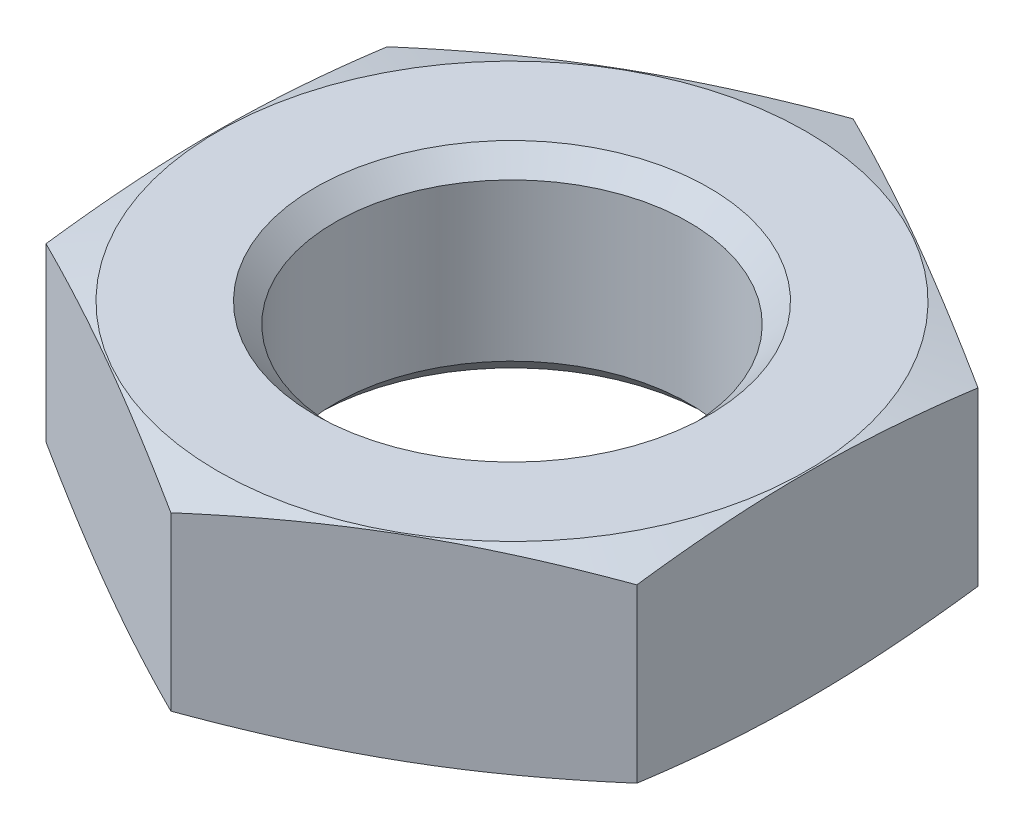
ISO-10303-21;
HEADER;
FILE_DESCRIPTION(('STEP AP214'),'2;1');
FILE_NAME('part.step','',(''),(''),'','','');
FILE_SCHEMA(('AUTOMOTIVE_DESIGN { 1 0 10303 214 1 1 1 1 }'));
ENDSEC;
DATA;
#1=APPLICATION_CONTEXT('core data for automotive mechanical design processes');
#2=APPLICATION_PROTOCOL_DEFINITION('international standard','automotive_design',2000,#1);
#3=PRODUCT_CONTEXT('',#1,'mechanical');
#4=PRODUCT('Part','Part','',(#3));
#5=PRODUCT_RELATED_PRODUCT_CATEGORY('part','',(#4));
#6=PRODUCT_DEFINITION_FORMATION('','',#4);
#7=PRODUCT_DEFINITION_CONTEXT('part definition',#1,'design');
#8=PRODUCT_DEFINITION('design','',#6,#7);
#9=PRODUCT_DEFINITION_SHAPE('','',#8);
#10=(LENGTH_UNIT() NAMED_UNIT(*) SI_UNIT(.MILLI.,.METRE.));
#11=(NAMED_UNIT(*) PLANE_ANGLE_UNIT() SI_UNIT($,.RADIAN.));
#12=(NAMED_UNIT(*) SI_UNIT($,.STERADIAN.) SOLID_ANGLE_UNIT());
#13=UNCERTAINTY_MEASURE_WITH_UNIT(LENGTH_MEASURE(1.E-05),#10,'distance_accuracy_value','');
#14=(GEOMETRIC_REPRESENTATION_CONTEXT(3) GLOBAL_UNCERTAINTY_ASSIGNED_CONTEXT((#13)) GLOBAL_UNIT_ASSIGNED_CONTEXT((#10,
#11,#12)) REPRESENTATION_CONTEXT('',''));
#15=CARTESIAN_POINT('',(0.,0.,0.));
#16=DIRECTION('',(0.,0.,1.));
#17=DIRECTION('',(1.,0.,0.));
#18=AXIS2_PLACEMENT_3D('',#15,#16,#17);
#19=CARTESIAN_POINT('',(0.,0.,0.));
#20=DIRECTION('',(0.,1.,0.));
#21=DIRECTION('',(0.,0.,1.));
#22=AXIS2_PLACEMENT_3D('',#19,#20,#21);
#23=PLANE('',#22);
#24=CARTESIAN_POINT('',(0.,0.,0.));
#25=DIRECTION('',(0.,-1.,0.));
#26=DIRECTION('',(0.,0.,-1.));
#27=AXIS2_PLACEMENT_3D('',#24,#25,#26);
#28=CIRCLE('',#27,11.95);
#29=CARTESIAN_POINT('',(0.,0.,-11.95));
#30=VERTEX_POINT('',#29);
#31=EDGE_CURVE('E119',#30,#30,#28,.T.);
#32=ORIENTED_EDGE('',*,*,#31,.F.);
#33=EDGE_LOOP('',(#32));
#34=FACE_BOUND('',#33,.T.);
#35=CARTESIAN_POINT('',(0.,0.,0.));
#36=DIRECTION('',(0.,1.,0.));
#37=DIRECTION('',(0.,0.,1.));
#38=AXIS2_PLACEMENT_3D('',#35,#36,#37);
#39=CIRCLE('',#38,8.);
#40=CARTESIAN_POINT('',(0.,0.,8.));
#41=VERTEX_POINT('',#40);
#42=EDGE_CURVE('E110',#41,#41,#39,.T.);
#43=ORIENTED_EDGE('',*,*,#42,.F.);
#44=EDGE_LOOP('',(#43));
#45=FACE_BOUND('',#44,.T.);
#46=ADVANCED_FACE('F41',(#34,#45),#23,.T.);
#47=CARTESIAN_POINT('',(11.95,-8.,0.));
#48=DIRECTION('',(0.,-1.,0.));
#49=DIRECTION('',(0.,0.,-1.));
#50=AXIS2_PLACEMENT_3D('',#47,#48,#49);
#51=PLANE('',#50);
#52=CARTESIAN_POINT('',(0.,-8.,0.));
#53=DIRECTION('',(0.,-1.,0.));
#54=DIRECTION('',(0.,0.,-1.));
#55=AXIS2_PLACEMENT_3D('',#52,#53,#54);
#56=CIRCLE('',#55,11.95);
#57=CARTESIAN_POINT('',(0.,-8.,-11.95));
#58=VERTEX_POINT('',#57);
#59=EDGE_CURVE('E116',#58,#58,#56,.T.);
#60=ORIENTED_EDGE('',*,*,#59,.T.);
#61=EDGE_LOOP('',(#60));
#62=FACE_BOUND('',#61,.T.);
#63=CARTESIAN_POINT('',(0.,-8.,0.));
#64=DIRECTION('',(0.,1.,0.));
#65=DIRECTION('',(0.,0.,1.));
#66=AXIS2_PLACEMENT_3D('',#63,#64,#65);
#67=CIRCLE('',#66,8.);
#68=CARTESIAN_POINT('',(0.,-8.,8.));
#69=VERTEX_POINT('',#68);
#70=EDGE_CURVE('E354',#69,#69,#67,.T.);
#71=ORIENTED_EDGE('',*,*,#70,.T.);
#72=EDGE_LOOP('',(#71));
#73=FACE_BOUND('',#72,.T.);
#74=ADVANCED_FACE('F142',(#62,#73),#51,.T.);
#75=CARTESIAN_POINT('',(0.,-4.,0.));
#76=DIRECTION('',(0.,-1.,0.));
#77=DIRECTION('',(0.,0.,-1.));
#78=AXIS2_PLACEMENT_3D('',#75,#76,#77);
#79=CONICAL_SURFACE('',#78,26.878203230276,1.30899693899576);
#80=ORIENTED_EDGE('',*,*,#31,.T.);
#81=EDGE_LOOP('',(#80));
#82=FACE_BOUND('',#81,.T.);
#83=CARTESIAN_POINT('',(0.000200000000000058,-0.510851012044523,-13.8565219306048));
#84=CARTESIAN_POINT('',(-0.498146454182599,-0.433725446206075,-13.5688014711328));
#85=CARTESIAN_POINT('',(-0.997396444623649,-0.363708257028747,-13.2805593547588));
#86=CARTESIAN_POINT('',(-1.99765949891959,-0.240694738972747,-12.7030572111006));
#87=CARTESIAN_POINT('',(-2.49867319556912,-0.187705323065098,-12.4137968184723));
#88=CARTESIAN_POINT('',(-3.49942613336507,-0.101840731579633,-11.8360118404435));
#89=CARTESIAN_POINT('',(-3.99915860797725,-0.0688631626605933,-11.5474911617033));
#90=CARTESIAN_POINT('',(-4.99926081641629,-0.0246436291699184,-10.9700818824439));
#91=CARTESIAN_POINT('',(-5.49963040820814,-0.0133974596215532,-10.6811933639286));
#92=CARTESIAN_POINT('',(-6.50036959179186,-0.0133974596215535,-10.1034163268979));
#93=CARTESIAN_POINT('',(-7.00073918358372,-0.0246436291699189,-9.81452780838259));
#94=CARTESIAN_POINT('',(-8.00084139202275,-0.0688631626605943,-9.23711852912317));
#95=CARTESIAN_POINT('',(-8.50057386663493,-0.101840731579634,-8.94859785038303));
#96=CARTESIAN_POINT('',(-9.50132680443088,-0.1877053230651,-8.37081287235423));
#97=CARTESIAN_POINT('',(-10.0023405010804,-0.24069473897275,-8.08155247972594));
#98=CARTESIAN_POINT('',(-11.0026035553764,-0.363708257028751,-7.50405033606774));
#99=CARTESIAN_POINT('',(-11.5018535458174,-0.43372544620608,-7.21580821969368));
#100=CARTESIAN_POINT('',(-12.0002,-0.510851012044527,-6.92808776022166));
#101=B_SPLINE_CURVE_WITH_KNOTS('',3,(#83,#84,#85,#86,#87,#88,#89,#90,#91,#92,#93,#94,#95,#96,
#97,#98,#99,#100),.UNSPECIFIED.,.F.,.F.,(4,2,2,2,2,2,2,2,4),(0.,1.74185054469228,
3.48440735870376,5.21797126724054,6.95119970147062,8.68442813570069,10.4179920442375,
12.160548858249,13.9023994029412),.UNSPECIFIED.);
#102=CARTESIAN_POINT('',(0.,-0.510820071550099,-13.856406460551));
#103=VERTEX_POINT('',#102);
#104=CARTESIAN_POINT('',(-12.,-0.510820071550103,-6.9282032302755));
#105=VERTEX_POINT('',#104);
#106=EDGE_CURVE('E115',#103,#105,#101,.T.);
#107=ORIENTED_EDGE('',*,*,#106,.T.);
#108=CARTESIAN_POINT('',(-12.,-2.72200243573631,-18.5685881589845));
#109=CARTESIAN_POINT('',(-12.,-2.59887367410678,-18.0213144233399));
#110=CARTESIAN_POINT('',(-12.,-2.47721112690191,-17.4737049482329));
#111=CARTESIAN_POINT('',(-12.,-2.23761044271416,-16.3776490741173));
#112=CARTESIAN_POINT('',(-12.,-2.11967245964341,-15.8292026415019));
#113=CARTESIAN_POINT('',(-12.,-1.88821805394612,-14.7308536896472));
#114=CARTESIAN_POINT('',(-12.,-1.7747057470629,-14.1809503000857));
#115=CARTESIAN_POINT('',(-12.,-1.55328922851542,-13.0800161890277));
#116=CARTESIAN_POINT('',(-12.,-1.44538497183806,-12.5289854766164));
#117=CARTESIAN_POINT('',(-12.,-1.23738313901807,-11.4301285119202));
#118=CARTESIAN_POINT('',(-12.,-1.1372287766694,-10.8823130603761));
#119=CARTESIAN_POINT('',(-12.,-0.94539932182392,-9.78518803384904));
#120=CARTESIAN_POINT('',(-12.,-0.853724259748671,-9.23587845351272));
#121=CARTESIAN_POINT('',(-12.,-0.680869488273906,-8.13564720164665));
#122=CARTESIAN_POINT('',(-12.,-0.599688831632448,-7.58472568021016));
#123=CARTESIAN_POINT('',(-12.,-0.45016964484819,-6.48112261453464));
#124=CARTESIAN_POINT('',(-12.,-0.381831137110084,-5.92844106722672));
#125=CARTESIAN_POINT('',(-12.,-0.259875137443977,-4.81496459343015));
#126=CARTESIAN_POINT('',(-12.,-0.206436959937335,-4.25414973515133));
#127=CARTESIAN_POINT('',(-12.,-0.117937409932045,-3.13105911511348));
#128=CARTESIAN_POINT('',(-12.,-0.082875615099266,-2.56878338722729));
#129=CARTESIAN_POINT('',(-12.,-0.0331702079703489,-1.44359947920516));
#130=CARTESIAN_POINT('',(-12.,-0.0185161724162358,-0.880691768998626));
#131=CARTESIAN_POINT('',(-12.,-0.0105322094798444,0.245276542205507));
#132=CARTESIAN_POINT('',(-12.,-0.0172022244136304,0.808337142785403));
#133=CARTESIAN_POINT('',(-12.,-0.0514991431895747,1.93602470881299));
#134=CARTESIAN_POINT('',(-12.,-0.0792084260695917,2.50064911702469));
#135=CARTESIAN_POINT('',(-12.,-0.153987570721919,3.62860269943232));
#136=CARTESIAN_POINT('',(-12.,-0.201057877482643,4.191931843559));
#137=CARTESIAN_POINT('',(-12.,-0.312122503045244,5.31729206801284));
#138=CARTESIAN_POINT('',(-12.,-0.37612867825736,5.87932195961845));
#139=CARTESIAN_POINT('',(-12.,-0.518327678875515,7.00156206794212));
#140=CARTESIAN_POINT('',(-12.,-0.596520524071002,7.56177228212074));
#141=CARTESIAN_POINT('',(-12.,-0.766895056384889,8.69626616322598));
#142=CARTESIAN_POINT('',(-12.,-0.859410078687846,9.27049930408447));
#143=CARTESIAN_POINT('',(-12.,-1.05429882669755,10.4172994207027));
#144=CARTESIAN_POINT('',(-12.,-1.15667292750077,10.9898663322149));
#145=CARTESIAN_POINT('',(-12.,-1.36930877556067,12.133607994569));
#146=CARTESIAN_POINT('',(-12.,-1.47957161960214,12.7047825403681));
#147=CARTESIAN_POINT('',(-12.,-1.70639259662026,13.8458673155559));
#148=CARTESIAN_POINT('',(-12.,-1.8229506482758,14.4157775611777));
#149=CARTESIAN_POINT('',(-12.,-2.06116971090088,15.5547484527927));
#150=CARTESIAN_POINT('',(-12.,-2.1828326035334,16.1238087039973));
#151=CARTESIAN_POINT('',(-12.,-2.43025398289181,17.2610373820955));
#152=CARTESIAN_POINT('',(-12.,-2.55601247903592,17.8292058069352));
#153=CARTESIAN_POINT('',(-12.,-2.81085668528537,18.9647431445852));
#154=CARTESIAN_POINT('',(-12.,-2.93994210724294,19.5321121221771));
#155=CARTESIAN_POINT('',(-12.,-3.2008620713177,20.6662181855463));
#156=CARTESIAN_POINT('',(-12.,-3.33269662086052,21.2329552696124));
#157=CARTESIAN_POINT('',(-12.,-3.72858989385038,22.9195613633749));
#158=CARTESIAN_POINT('',(-12.,-3.99594280080609,24.0386569627157));
#159=CARTESIAN_POINT('',(-12.,-4.53688835016327,26.2753619296082));
#160=CARTESIAN_POINT('',(-12.,-4.81048114599739,27.3929712598974));
#161=CARTESIAN_POINT('',(-12.,-5.36180720199379,29.6253788982862));
#162=CARTESIAN_POINT('',(-12.,-5.63953359587728,30.7401789038594));
#163=CARTESIAN_POINT('',(-12.,-6.05867034126459,32.4117164998776));
#164=CARTESIAN_POINT('',(-12.,-6.19880444745633,32.9687747923526));
#165=CARTESIAN_POINT('',(-12.,-6.47982167483764,34.0827018740917));
#166=CARTESIAN_POINT('',(-12.,-6.62070479530794,34.6395706635373));
#167=CARTESIAN_POINT('',(-12.,-6.76191169280589,35.1963573745801));
#168=B_SPLINE_CURVE_WITH_KNOTS('',3,(#108,#109,#110,#111,#112,#113,#114,#115,#116,#117,#118,
#119,#120,#121,#122,#123,#124,#125,#126,#127,#128,#129,#130,#131,#132,#133,#134,#135,#136,#137,
#138,#139,#140,#141,#142,#143,#144,#145,#146,#147,#148,#149,#150,#151,#152,#153,#154,#155,#156,
#157,#158,#159,#160,#161,#162,#163,#164,#165,#166,#167),.UNSPECIFIED.,.F.,.F.,(4,2,2,2,2,2,2,2,
2,2,2,2,2,2,2,2,2,2,2,2,2,2,2,2,2,2,2,2,2,4),(0.,1.68286813278142,3.36580571685892,
5.05027276265678,6.73472628597062,8.40535978198167,10.0759992715661,11.7464878610926,
13.416979364963,15.1067824841314,16.7965467657959,18.4854476838572,20.174344033257,
21.8698875600161,23.5654700588562,25.262242751023,26.9590178100915,28.7038248804626,
30.4486983596481,32.1938149046289,33.9389089116925,35.6846519169557,37.4303989369993,
39.1759952612339,40.9215963010863,44.3733305526461,47.8251497706189,51.2717634428849,
52.9950052531451,54.7182454089179),.UNSPECIFIED.);
#169=CARTESIAN_POINT('',(-12.,-0.510820071550103,6.9282032302755));
#170=VERTEX_POINT('',#169);
#171=EDGE_CURVE('E107',#105,#170,#168,.T.);
#172=ORIENTED_EDGE('',*,*,#171,.T.);
#173=CARTESIAN_POINT('',(-12.0002,-0.510851012044527,6.92808776022166));
#174=CARTESIAN_POINT('',(-11.5018535458174,-0.433725446206079,7.21580821969368));
#175=CARTESIAN_POINT('',(-11.0026035553764,-0.363708257028751,7.50405033606774));
#176=CARTESIAN_POINT('',(-10.0023405010804,-0.240694738972751,8.08155247972594));
#177=CARTESIAN_POINT('',(-9.50132680443088,-0.187705323065101,8.37081287235423));
#178=CARTESIAN_POINT('',(-8.50057386663493,-0.101840731579635,8.94859785038303));
#179=CARTESIAN_POINT('',(-8.00084139202275,-0.0688631626605953,9.23711852912317));
#180=CARTESIAN_POINT('',(-7.00073918358372,-0.0246436291699196,9.81452780838258));
#181=CARTESIAN_POINT('',(-6.50036959179186,-0.013397459621554,10.1034163268979));
#182=CARTESIAN_POINT('',(-5.49963040820814,-0.0133974596215531,10.6811933639286));
#183=CARTESIAN_POINT('',(-4.99926081641628,-0.0246436291699177,10.9700818824439));
#184=CARTESIAN_POINT('',(-3.99915860797725,-0.0688631626605927,11.5474911617033));
#185=CARTESIAN_POINT('',(-3.49942613336507,-0.101840731579633,11.8360118404435));
#186=CARTESIAN_POINT('',(-2.49867319556912,-0.187705323065099,12.4137968184723));
#187=CARTESIAN_POINT('',(-1.99765949891959,-0.240694738972748,12.7030572111006));
#188=CARTESIAN_POINT('',(-0.997396444623647,-0.363708257028748,13.2805593547588));
#189=CARTESIAN_POINT('',(-0.498146454182598,-0.433725446206076,13.5688014711328));
#190=CARTESIAN_POINT('',(0.000200000000001651,-0.510851012044524,13.8565219306048));
#191=B_SPLINE_CURVE_WITH_KNOTS('',3,(#173,#174,#175,#176,#177,#178,#179,#180,#181,#182,#183,
#184,#185,#186,#187,#188,#189,#190),.UNSPECIFIED.,.F.,.F.,(4,2,2,2,2,2,2,2,4),(0.,
1.74185054469228,3.48440735870376,5.21797126724054,6.95119970147062,8.68442813570069,
10.4179920442375,12.160548858249,13.9023994029412),.UNSPECIFIED.);
#192=CARTESIAN_POINT('',(0.,-0.510820071550099,13.856406460551));
#193=VERTEX_POINT('',#192);
#194=EDGE_CURVE('E96',#170,#193,#191,.T.);
#195=ORIENTED_EDGE('',*,*,#194,.T.);
#196=CARTESIAN_POINT('',(-0.000200000000000058,-0.510851012044523,13.8565219306048));
#197=CARTESIAN_POINT('',(0.498146454182599,-0.433725446206075,13.5688014711328));
#198=CARTESIAN_POINT('',(0.997396444623649,-0.363708257028747,13.2805593547588));
#199=CARTESIAN_POINT('',(1.99765949891959,-0.240694738972747,12.7030572111006));
#200=CARTESIAN_POINT('',(2.49867319556912,-0.187705323065098,12.4137968184723));
#201=CARTESIAN_POINT('',(3.49942613336507,-0.101840731579633,11.8360118404435));
#202=CARTESIAN_POINT('',(3.99915860797725,-0.0688631626605933,11.5474911617033));
#203=CARTESIAN_POINT('',(4.99926081641629,-0.0246436291699184,10.9700818824439));
#204=CARTESIAN_POINT('',(5.49963040820814,-0.0133974596215532,10.6811933639286));
#205=CARTESIAN_POINT('',(6.50036959179186,-0.0133974596215535,10.1034163268979));
#206=CARTESIAN_POINT('',(7.00073918358372,-0.0246436291699189,9.81452780838259));
#207=CARTESIAN_POINT('',(8.00084139202275,-0.0688631626605943,9.23711852912317));
#208=CARTESIAN_POINT('',(8.50057386663493,-0.101840731579634,8.94859785038303));
#209=CARTESIAN_POINT('',(9.50132680443088,-0.1877053230651,8.37081287235423));
#210=CARTESIAN_POINT('',(10.0023405010804,-0.24069473897275,8.08155247972594));
#211=CARTESIAN_POINT('',(11.0026035553764,-0.363708257028751,7.50405033606774));
#212=CARTESIAN_POINT('',(11.5018535458174,-0.43372544620608,7.21580821969368));
#213=CARTESIAN_POINT('',(12.0002,-0.510851012044527,6.92808776022166));
#214=B_SPLINE_CURVE_WITH_KNOTS('',3,(#196,#197,#198,#199,#200,#201,#202,#203,#204,#205,#206,
#207,#208,#209,#210,#211,#212,#213),.UNSPECIFIED.,.F.,.F.,(4,2,2,2,2,2,2,2,4),(0.,
1.74185054469228,3.48440735870376,5.21797126724054,6.95119970147062,8.68442813570069,
10.4179920442375,12.160548858249,13.9023994029412),.UNSPECIFIED.);
#215=CARTESIAN_POINT('',(12.,-0.510820071550103,6.9282032302755));
#216=VERTEX_POINT('',#215);
#217=EDGE_CURVE('E101',#193,#216,#214,.T.);
#218=ORIENTED_EDGE('',*,*,#217,.T.);
#219=CARTESIAN_POINT('',(12.,-2.72200243573631,-18.5685881589845));
#220=CARTESIAN_POINT('',(12.,-2.59887367410678,-18.0213144233399));
#221=CARTESIAN_POINT('',(12.,-2.47721112690191,-17.4737049482329));
#222=CARTESIAN_POINT('',(12.,-2.23761044271416,-16.3776490741173));
#223=CARTESIAN_POINT('',(12.,-2.11967245964341,-15.8292026415019));
#224=CARTESIAN_POINT('',(12.,-1.88821805394612,-14.7308536896472));
#225=CARTESIAN_POINT('',(12.,-1.7747057470629,-14.1809503000857));
#226=CARTESIAN_POINT('',(12.,-1.55328922851542,-13.0800161890277));
#227=CARTESIAN_POINT('',(12.,-1.44538497183806,-12.5289854766164));
#228=CARTESIAN_POINT('',(12.,-1.23738313901807,-11.4301285119202));
#229=CARTESIAN_POINT('',(12.,-1.1372287766694,-10.8823130603761));
#230=CARTESIAN_POINT('',(12.,-0.94539932182392,-9.78518803384904));
#231=CARTESIAN_POINT('',(12.,-0.853724259748671,-9.23587845351272));
#232=CARTESIAN_POINT('',(12.,-0.680869488273906,-8.13564720164665));
#233=CARTESIAN_POINT('',(12.,-0.599688831632448,-7.58472568021016));
#234=CARTESIAN_POINT('',(12.,-0.45016964484819,-6.48112261453464));
#235=CARTESIAN_POINT('',(12.,-0.381831137110084,-5.92844106722672));
#236=CARTESIAN_POINT('',(12.,-0.259875137443977,-4.81496459343015));
#237=CARTESIAN_POINT('',(12.,-0.206436959937335,-4.25414973515133));
#238=CARTESIAN_POINT('',(12.,-0.117937409932045,-3.13105911511348));
#239=CARTESIAN_POINT('',(12.,-0.082875615099266,-2.56878338722729));
#240=CARTESIAN_POINT('',(12.,-0.0331702079703489,-1.44359947920516));
#241=CARTESIAN_POINT('',(12.,-0.0185161724162358,-0.880691768998626));
#242=CARTESIAN_POINT('',(12.,-0.0105322094798444,0.245276542205507));
#243=CARTESIAN_POINT('',(12.,-0.0172022244136304,0.808337142785403));
#244=CARTESIAN_POINT('',(12.,-0.0514991431895747,1.93602470881299));
#245=CARTESIAN_POINT('',(12.,-0.0792084260695917,2.50064911702469));
#246=CARTESIAN_POINT('',(12.,-0.153987570721919,3.62860269943232));
#247=CARTESIAN_POINT('',(12.,-0.201057877482643,4.191931843559));
#248=CARTESIAN_POINT('',(12.,-0.312122503045244,5.31729206801284));
#249=CARTESIAN_POINT('',(12.,-0.37612867825736,5.87932195961845));
#250=CARTESIAN_POINT('',(12.,-0.518327678875515,7.00156206794212));
#251=CARTESIAN_POINT('',(12.,-0.596520524071002,7.56177228212074));
#252=CARTESIAN_POINT('',(12.,-0.766895056384889,8.69626616322598));
#253=CARTESIAN_POINT('',(12.,-0.859410078687846,9.27049930408447));
#254=CARTESIAN_POINT('',(12.,-1.05429882669755,10.4172994207027));
#255=CARTESIAN_POINT('',(12.,-1.15667292750077,10.9898663322149));
#256=CARTESIAN_POINT('',(12.,-1.36930877556067,12.133607994569));
#257=CARTESIAN_POINT('',(12.,-1.47957161960214,12.7047825403681));
#258=CARTESIAN_POINT('',(12.,-1.70639259662026,13.8458673155559));
#259=CARTESIAN_POINT('',(12.,-1.8229506482758,14.4157775611777));
#260=CARTESIAN_POINT('',(12.,-2.06116971090088,15.5547484527927));
#261=CARTESIAN_POINT('',(12.,-2.1828326035334,16.1238087039973));
#262=CARTESIAN_POINT('',(12.,-2.43025398289181,17.2610373820955));
#263=CARTESIAN_POINT('',(12.,-2.55601247903592,17.8292058069352));
#264=CARTESIAN_POINT('',(12.,-2.81085668528537,18.9647431445852));
#265=CARTESIAN_POINT('',(12.,-2.93994210724294,19.5321121221771));
#266=CARTESIAN_POINT('',(12.,-3.2008620713177,20.6662181855463));
#267=CARTESIAN_POINT('',(12.,-3.33269662086052,21.2329552696124));
#268=CARTESIAN_POINT('',(12.,-3.72858989385038,22.9195613633749));
#269=CARTESIAN_POINT('',(12.,-3.99594280080609,24.0386569627157));
#270=CARTESIAN_POINT('',(12.,-4.53688835016327,26.2753619296082));
#271=CARTESIAN_POINT('',(12.,-4.81048114599739,27.3929712598974));
#272=CARTESIAN_POINT('',(12.,-5.36180720199379,29.6253788982862));
#273=CARTESIAN_POINT('',(12.,-5.63953359587728,30.7401789038594));
#274=CARTESIAN_POINT('',(12.,-6.05867034126459,32.4117164998776));
#275=CARTESIAN_POINT('',(12.,-6.19880444745633,32.9687747923526));
#276=CARTESIAN_POINT('',(12.,-6.47982167483764,34.0827018740917));
#277=CARTESIAN_POINT('',(12.,-6.62070479530794,34.6395706635373));
#278=CARTESIAN_POINT('',(12.,-6.76191169280589,35.1963573745801));
#279=B_SPLINE_CURVE_WITH_KNOTS('',3,(#219,#220,#221,#222,#223,#224,#225,#226,#227,#228,#229,
#230,#231,#232,#233,#234,#235,#236,#237,#238,#239,#240,#241,#242,#243,#244,#245,#246,#247,#248,
#249,#250,#251,#252,#253,#254,#255,#256,#257,#258,#259,#260,#261,#262,#263,#264,#265,#266,#267,
#268,#269,#270,#271,#272,#273,#274,#275,#276,#277,#278),.UNSPECIFIED.,.F.,.F.,(4,2,2,2,2,2,2,2,
2,2,2,2,2,2,2,2,2,2,2,2,2,2,2,2,2,2,2,2,2,4),(0.,1.68286813278142,3.36580571685892,
5.05027276265678,6.73472628597062,8.40535978198167,10.0759992715661,11.7464878610926,
13.416979364963,15.1067824841314,16.7965467657959,18.4854476838572,20.174344033257,
21.8698875600161,23.5654700588562,25.262242751023,26.9590178100915,28.7038248804626,
30.4486983596481,32.1938149046289,33.9389089116925,35.6846519169557,37.4303989369993,
39.1759952612339,40.9215963010863,44.3733305526461,47.8251497706189,51.2717634428849,
52.9950052531451,54.7182454089179),.UNSPECIFIED.);
#280=CARTESIAN_POINT('',(12.,-0.510820071550103,-6.9282032302755));
#281=VERTEX_POINT('',#280);
#282=EDGE_CURVE('E205',#216,#281,#279,.F.);
#283=ORIENTED_EDGE('',*,*,#282,.T.);
#284=CARTESIAN_POINT('',(12.0002,-0.510851012044527,-6.92808776022166));
#285=CARTESIAN_POINT('',(11.5018535458174,-0.433725446206079,-7.21580821969368));
#286=CARTESIAN_POINT('',(11.0026035553764,-0.363708257028751,-7.50405033606774));
#287=CARTESIAN_POINT('',(10.0023405010804,-0.240694738972751,-8.08155247972594));
#288=CARTESIAN_POINT('',(9.50132680443088,-0.187705323065101,-8.37081287235423));
#289=CARTESIAN_POINT('',(8.50057386663493,-0.101840731579635,-8.94859785038303));
#290=CARTESIAN_POINT('',(8.00084139202275,-0.0688631626605953,-9.23711852912317));
#291=CARTESIAN_POINT('',(7.00073918358372,-0.0246436291699196,-9.81452780838258));
#292=CARTESIAN_POINT('',(6.50036959179186,-0.013397459621554,-10.1034163268979));
#293=CARTESIAN_POINT('',(5.49963040820814,-0.0133974596215531,-10.6811933639286));
#294=CARTESIAN_POINT('',(4.99926081641628,-0.0246436291699177,-10.9700818824439));
#295=CARTESIAN_POINT('',(3.99915860797725,-0.0688631626605927,-11.5474911617033));
#296=CARTESIAN_POINT('',(3.49942613336507,-0.101840731579633,-11.8360118404435));
#297=CARTESIAN_POINT('',(2.49867319556912,-0.187705323065099,-12.4137968184723));
#298=CARTESIAN_POINT('',(1.99765949891959,-0.240694738972748,-12.7030572111006));
#299=CARTESIAN_POINT('',(0.997396444623647,-0.363708257028748,-13.2805593547588));
#300=CARTESIAN_POINT('',(0.498146454182598,-0.433725446206076,-13.5688014711328));
#301=CARTESIAN_POINT('',(-0.000200000000001651,-0.510851012044524,-13.8565219306048));
#302=B_SPLINE_CURVE_WITH_KNOTS('',3,(#284,#285,#286,#287,#288,#289,#290,#291,#292,#293,#294,
#295,#296,#297,#298,#299,#300,#301),.UNSPECIFIED.,.F.,.F.,(4,2,2,2,2,2,2,2,4),(0.,
1.74185054469228,3.48440735870376,5.21797126724054,6.95119970147062,8.68442813570069,
10.4179920442375,12.160548858249,13.9023994029412),.UNSPECIFIED.);
#303=EDGE_CURVE('E121',#281,#103,#302,.T.);
#304=ORIENTED_EDGE('',*,*,#303,.T.);
#305=EDGE_LOOP('',(#107,#172,#195,#218,#283,#304));
#306=FACE_BOUND('',#305,.T.);
#307=ADVANCED_FACE('F113',(#82,#306),#79,.T.);
#308=CARTESIAN_POINT('',(-12.,-9.,-6.9282032302755));
#309=DIRECTION('',(-1.,0.,0.));
#310=DIRECTION('',(0.,0.,1.));
#311=AXIS2_PLACEMENT_3D('',#308,#309,#310);
#312=PLANE('',#311);
#313=DIRECTION('',(0.,1.,0.));
#314=VECTOR('',#313,1.);
#315=CARTESIAN_POINT('',(-12.,-9.,-6.9282032302755));
#316=LINE('',#315,#314);
#317=CARTESIAN_POINT('',(-12.,-7.4891799284499,-6.9282032302755));
#318=VERTEX_POINT('',#317);
#319=EDGE_CURVE('E102',#318,#105,#316,.T.);
#320=ORIENTED_EDGE('',*,*,#319,.F.);
#321=CARTESIAN_POINT('',(-12.,-5.27799756426369,-18.5685881589845));
#322=CARTESIAN_POINT('',(-12.,-5.40112632589322,-18.0213144233399));
#323=CARTESIAN_POINT('',(-12.,-5.52278887309809,-17.4737049482329));
#324=CARTESIAN_POINT('',(-12.,-5.76238955728584,-16.3776490741173));
#325=CARTESIAN_POINT('',(-12.,-5.88032754035659,-15.8292026415019));
#326=CARTESIAN_POINT('',(-12.,-6.11178194605388,-14.7308536896472));
#327=CARTESIAN_POINT('',(-12.,-6.2252942529371,-14.1809503000857));
#328=CARTESIAN_POINT('',(-12.,-6.44671077148458,-13.0800161890277));
#329=CARTESIAN_POINT('',(-12.,-6.55461502816194,-12.5289854766164));
#330=CARTESIAN_POINT('',(-12.,-6.76261686098193,-11.4301285119202));
#331=CARTESIAN_POINT('',(-12.,-6.8627712233306,-10.8823130603761));
#332=CARTESIAN_POINT('',(-12.,-7.05460067817608,-9.78518803384904));
#333=CARTESIAN_POINT('',(-12.,-7.14627574025133,-9.23587845351272));
#334=CARTESIAN_POINT('',(-12.,-7.31913051172609,-8.13564720164665));
#335=CARTESIAN_POINT('',(-12.,-7.40031116836755,-7.58472568021017));
#336=CARTESIAN_POINT('',(-12.,-7.54983035515181,-6.48112261453464));
#337=CARTESIAN_POINT('',(-12.,-7.61816886288992,-5.92844106722673));
#338=CARTESIAN_POINT('',(-12.,-7.74012486255602,-4.81496459343016));
#339=CARTESIAN_POINT('',(-12.,-7.79356304006266,-4.25414973515134));
#340=CARTESIAN_POINT('',(-12.,-7.88206259006795,-3.13105911511348));
#341=CARTESIAN_POINT('',(-12.,-7.91712438490074,-2.5687833872273));
#342=CARTESIAN_POINT('',(-12.,-7.96682979202965,-1.44359947920516));
#343=CARTESIAN_POINT('',(-12.,-7.98148382758376,-0.880691768998631));
#344=CARTESIAN_POINT('',(-12.,-7.98946779052015,0.245276542205502));
#345=CARTESIAN_POINT('',(-12.,-7.98279777558637,0.808337142785398));
#346=CARTESIAN_POINT('',(-12.,-7.94850085681043,1.93602470881299));
#347=CARTESIAN_POINT('',(-12.,-7.92079157393041,2.50064911702468));
#348=CARTESIAN_POINT('',(-12.,-7.84601242927808,3.62860269943232));
#349=CARTESIAN_POINT('',(-12.,-7.79894212251736,4.19193184355899));
#350=CARTESIAN_POINT('',(-12.,-7.68787749695476,5.31729206801284));
#351=CARTESIAN_POINT('',(-12.,-7.62387132174264,5.87932195961845));
#352=CARTESIAN_POINT('',(-12.,-7.48167232112449,7.00156206794212));
#353=CARTESIAN_POINT('',(-12.,-7.403479475929,7.56177228212075));
#354=CARTESIAN_POINT('',(-12.,-7.23310494361511,8.69626616322598));
#355=CARTESIAN_POINT('',(-12.,-7.14058992131215,9.27049930408447));
#356=CARTESIAN_POINT('',(-12.,-6.94570117330245,10.4172994207027));
#357=CARTESIAN_POINT('',(-12.,-6.84332707249923,10.9898663322149));
#358=CARTESIAN_POINT('',(-12.,-6.63069122443933,12.133607994569));
#359=CARTESIAN_POINT('',(-12.,-6.52042838039786,12.7047825403681));
#360=CARTESIAN_POINT('',(-12.,-6.29360740337974,13.8458673155559));
#361=CARTESIAN_POINT('',(-12.,-6.1770493517242,14.4157775611777));
#362=CARTESIAN_POINT('',(-12.,-5.93883028909912,15.5547484527927));
#363=CARTESIAN_POINT('',(-12.,-5.8171673964666,16.1238087039973));
#364=CARTESIAN_POINT('',(-12.,-5.56974601710819,17.2610373820955));
#365=CARTESIAN_POINT('',(-12.,-5.44398752096407,17.8292058069352));
#366=CARTESIAN_POINT('',(-12.,-5.18914331471462,18.9647431445852));
#367=CARTESIAN_POINT('',(-12.,-5.06005789275705,19.5321121221771));
#368=CARTESIAN_POINT('',(-12.,-4.7991379286823,20.6662181855463));
#369=CARTESIAN_POINT('',(-12.,-4.66730337913948,21.2329552696124));
#370=CARTESIAN_POINT('',(-12.,-4.27141010614962,22.9195613633749));
#371=CARTESIAN_POINT('',(-12.,-4.0040571991939,24.0386569627157));
#372=CARTESIAN_POINT('',(-12.,-3.46311164983673,26.2753619296083));
#373=CARTESIAN_POINT('',(-12.,-3.18951885400261,27.3929712598974));
#374=CARTESIAN_POINT('',(-12.,-2.6381927980062,29.6253788982862));
#375=CARTESIAN_POINT('',(-12.,-2.36046640412271,30.7401789038594));
#376=CARTESIAN_POINT('',(-12.,-1.94132965873541,32.4117164998776));
#377=CARTESIAN_POINT('',(-12.,-1.80119555254367,32.9687747923526));
#378=CARTESIAN_POINT('',(-12.,-1.52017832516236,34.0827018740917));
#379=CARTESIAN_POINT('',(-12.,-1.37929520469205,34.6395706635373));
#380=CARTESIAN_POINT('',(-12.,-1.23808830719411,35.1963573745801));
#381=B_SPLINE_CURVE_WITH_KNOTS('',3,(#321,#322,#323,#324,#325,#326,#327,#328,#329,#330,#331,
#332,#333,#334,#335,#336,#337,#338,#339,#340,#341,#342,#343,#344,#345,#346,#347,#348,#349,#350,
#351,#352,#353,#354,#355,#356,#357,#358,#359,#360,#361,#362,#363,#364,#365,#366,#367,#368,#369,
#370,#371,#372,#373,#374,#375,#376,#377,#378,#379,#380),.UNSPECIFIED.,.F.,.F.,(4,2,2,2,2,2,2,2,
2,2,2,2,2,2,2,2,2,2,2,2,2,2,2,2,2,2,2,2,2,4),(0.,1.68286813278142,3.36580571685892,
5.05027276265679,6.73472628597062,8.40535978198167,10.0759992715661,11.7464878610926,
13.416979364963,15.1067824841313,16.7965467657959,18.4854476838572,20.174344033257,
21.8698875600161,23.5654700588562,25.262242751023,26.9590178100915,28.7038248804626,
30.4486983596481,32.1938149046289,33.9389089116925,35.6846519169557,37.4303989369994,
39.175995261234,40.9215963010863,44.3733305526461,47.8251497706189,51.2717634428849,
52.9950052531451,54.7182454089179),.UNSPECIFIED.);
#382=CARTESIAN_POINT('',(-12.,-7.4891799284499,6.9282032302755));
#383=VERTEX_POINT('',#382);
#384=EDGE_CURVE('E11',#383,#318,#381,.F.);
#385=ORIENTED_EDGE('',*,*,#384,.F.);
#386=DIRECTION('',(0.,1.,0.));
#387=VECTOR('',#386,1.);
#388=CARTESIAN_POINT('',(-12.,-9.,6.9282032302755));
#389=LINE('',#388,#387);
#390=EDGE_CURVE('E66',#383,#170,#389,.T.);
#391=ORIENTED_EDGE('',*,*,#390,.T.);
#392=ORIENTED_EDGE('',*,*,#171,.F.);
#393=EDGE_LOOP('',(#320,#385,#391,#392));
#394=FACE_BOUND('',#393,.T.);
#395=ADVANCED_FACE('F106',(#394),#312,.T.);
#396=CARTESIAN_POINT('',(0.,-9.,-13.856406460551));
#397=DIRECTION('',(-0.5,0.,-0.866025403784439));
#398=DIRECTION('',(-0.866025403784439,0.,0.5));
#399=AXIS2_PLACEMENT_3D('',#396,#397,#398);
#400=PLANE('',#399);
#401=DIRECTION('',(0.,1.,0.));
#402=VECTOR('',#401,1.);
#403=CARTESIAN_POINT('',(0.,-9.,-13.856406460551));
#404=LINE('',#403,#402);
#405=CARTESIAN_POINT('',(0.,-7.4891799284499,-13.856406460551));
#406=VERTEX_POINT('',#405);
#407=EDGE_CURVE('E249',#406,#103,#404,.T.);
#408=ORIENTED_EDGE('',*,*,#407,.F.);
#409=CARTESIAN_POINT('',(-12.0002,-7.48914898795547,-6.92808776022166));
#410=CARTESIAN_POINT('',(-11.5018535458174,-7.56627455379392,-7.21580821969368));
#411=CARTESIAN_POINT('',(-11.0026035553764,-7.63629174297125,-7.50405033606774));
#412=CARTESIAN_POINT('',(-10.0023405010804,-7.75930526102725,-8.08155247972594));
#413=CARTESIAN_POINT('',(-9.50132680443088,-7.8122946769349,-8.37081287235423));
#414=CARTESIAN_POINT('',(-8.50057386663493,-7.89815926842037,-8.94859785038303));
#415=CARTESIAN_POINT('',(-8.00084139202275,-7.93113683733941,-9.23711852912317));
#416=CARTESIAN_POINT('',(-7.00073918358371,-7.97535637083008,-9.81452780838259));
#417=CARTESIAN_POINT('',(-6.50036959179186,-7.98660254037845,-10.1034163268979));
#418=CARTESIAN_POINT('',(-5.49963040820814,-7.98660254037845,-10.6811933639286));
#419=CARTESIAN_POINT('',(-4.99926081641628,-7.97535637083008,-10.9700818824439));
#420=CARTESIAN_POINT('',(-3.99915860797725,-7.93113683733941,-11.5474911617033));
#421=CARTESIAN_POINT('',(-3.49942613336507,-7.89815926842037,-11.8360118404435));
#422=CARTESIAN_POINT('',(-2.49867319556912,-7.8122946769349,-12.4137968184723));
#423=CARTESIAN_POINT('',(-1.99765949891959,-7.75930526102725,-12.7030572111006));
#424=CARTESIAN_POINT('',(-0.997396444623646,-7.63629174297125,-13.2805593547588));
#425=CARTESIAN_POINT('',(-0.498146454182596,-7.56627455379393,-13.5688014711328));
#426=CARTESIAN_POINT('',(0.000200000000002022,-7.48914898795548,-13.8565219306048));
#427=B_SPLINE_CURVE_WITH_KNOTS('',3,(#409,#410,#411,#412,#413,#414,#415,#416,#417,#418,#419,
#420,#421,#422,#423,#424,#425,#426),.UNSPECIFIED.,.F.,.F.,(4,2,2,2,2,2,2,2,4),(0.,
1.74185054469228,3.48440735870376,5.21797126724054,6.95119970147062,8.68442813570069,
10.4179920442375,12.160548858249,13.9023994029412),.UNSPECIFIED.);
#428=EDGE_CURVE('E54',#318,#406,#427,.T.);
#429=ORIENTED_EDGE('',*,*,#428,.F.);
#430=ORIENTED_EDGE('',*,*,#319,.T.);
#431=ORIENTED_EDGE('',*,*,#106,.F.);
#432=EDGE_LOOP('',(#408,#429,#430,#431));
#433=FACE_BOUND('',#432,.T.);
#434=ADVANCED_FACE('F139',(#433),#400,.T.);
#435=CARTESIAN_POINT('',(12.,-9.,-6.9282032302755));
#436=DIRECTION('',(0.5,0.,-0.866025403784439));
#437=DIRECTION('',(-0.866025403784439,0.,-0.5));
#438=AXIS2_PLACEMENT_3D('',#435,#436,#437);
#439=PLANE('',#438);
#440=DIRECTION('',(0.,1.,0.));
#441=VECTOR('',#440,1.);
#442=CARTESIAN_POINT('',(12.,-9.,-6.9282032302755));
#443=LINE('',#442,#441);
#444=CARTESIAN_POINT('',(12.,-7.4891799284499,-6.9282032302755));
#445=VERTEX_POINT('',#444);
#446=EDGE_CURVE('E252',#445,#281,#443,.T.);
#447=ORIENTED_EDGE('',*,*,#446,.F.);
#448=CARTESIAN_POINT('',(-0.0002,-7.48914898795548,-13.8565219306048));
#449=CARTESIAN_POINT('',(0.498146454182599,-7.56627455379393,-13.5688014711328));
#450=CARTESIAN_POINT('',(0.99739644462365,-7.63629174297125,-13.2805593547588));
#451=CARTESIAN_POINT('',(1.99765949891959,-7.75930526102725,-12.7030572111006));
#452=CARTESIAN_POINT('',(2.49867319556912,-7.8122946769349,-12.4137968184723));
#453=CARTESIAN_POINT('',(3.49942613336508,-7.89815926842037,-11.8360118404435));
#454=CARTESIAN_POINT('',(3.99915860797726,-7.93113683733941,-11.5474911617033));
#455=CARTESIAN_POINT('',(4.99926081641629,-7.97535637083008,-10.9700818824439));
#456=CARTESIAN_POINT('',(5.49963040820814,-7.98660254037845,-10.6811933639286));
#457=CARTESIAN_POINT('',(6.50036959179186,-7.98660254037845,-10.1034163268979));
#458=CARTESIAN_POINT('',(7.00073918358372,-7.97535637083008,-9.81452780838258));
#459=CARTESIAN_POINT('',(8.00084139202275,-7.93113683733941,-9.23711852912317));
#460=CARTESIAN_POINT('',(8.50057386663493,-7.89815926842037,-8.94859785038303));
#461=CARTESIAN_POINT('',(9.50132680443088,-7.8122946769349,-8.37081287235423));
#462=CARTESIAN_POINT('',(10.0023405010804,-7.75930526102725,-8.08155247972594));
#463=CARTESIAN_POINT('',(11.0026035553764,-7.63629174297125,-7.50405033606774));
#464=CARTESIAN_POINT('',(11.5018535458174,-7.56627455379392,-7.21580821969368));
#465=CARTESIAN_POINT('',(12.0002,-7.48914898795547,-6.92808776022166));
#466=B_SPLINE_CURVE_WITH_KNOTS('',3,(#448,#449,#450,#451,#452,#453,#454,#455,#456,#457,#458,
#459,#460,#461,#462,#463,#464,#465),.UNSPECIFIED.,.F.,.F.,(4,2,2,2,2,2,2,2,4),(0.,
1.74185054469228,3.48440735870376,5.21797126724054,6.95119970147062,8.68442813570069,
10.4179920442375,12.160548858249,13.9023994029412),.UNSPECIFIED.);
#467=EDGE_CURVE('E176',#406,#445,#466,.T.);
#468=ORIENTED_EDGE('',*,*,#467,.F.);
#469=ORIENTED_EDGE('',*,*,#407,.T.);
#470=ORIENTED_EDGE('',*,*,#303,.F.);
#471=EDGE_LOOP('',(#447,#468,#469,#470));
#472=FACE_BOUND('',#471,.T.);
#473=ADVANCED_FACE('F190',(#472),#439,.T.);
#474=CARTESIAN_POINT('',(12.,-9.,6.9282032302755));
#475=DIRECTION('',(1.,0.,0.));
#476=DIRECTION('',(0.,0.,-1.));
#477=AXIS2_PLACEMENT_3D('',#474,#475,#476);
#478=PLANE('',#477);
#479=DIRECTION('',(0.,1.,0.));
#480=VECTOR('',#479,1.);
#481=CARTESIAN_POINT('',(12.,-9.,6.9282032302755));
#482=LINE('',#481,#480);
#483=CARTESIAN_POINT('',(12.,-7.4891799284499,6.9282032302755));
#484=VERTEX_POINT('',#483);
#485=EDGE_CURVE('E255',#484,#216,#482,.T.);
#486=ORIENTED_EDGE('',*,*,#485,.F.);
#487=CARTESIAN_POINT('',(12.,-5.27799756426369,-18.5685881589845));
#488=CARTESIAN_POINT('',(12.,-5.40112632589322,-18.0213144233399));
#489=CARTESIAN_POINT('',(12.,-5.52278887309809,-17.4737049482329));
#490=CARTESIAN_POINT('',(12.,-5.76238955728584,-16.3776490741173));
#491=CARTESIAN_POINT('',(12.,-5.88032754035659,-15.8292026415019));
#492=CARTESIAN_POINT('',(12.,-6.11178194605388,-14.7308536896472));
#493=CARTESIAN_POINT('',(12.,-6.2252942529371,-14.1809503000857));
#494=CARTESIAN_POINT('',(12.,-6.44671077148458,-13.0800161890277));
#495=CARTESIAN_POINT('',(12.,-6.55461502816194,-12.5289854766164));
#496=CARTESIAN_POINT('',(12.,-6.76261686098193,-11.4301285119202));
#497=CARTESIAN_POINT('',(12.,-6.8627712233306,-10.8823130603761));
#498=CARTESIAN_POINT('',(12.,-7.05460067817608,-9.78518803384904));
#499=CARTESIAN_POINT('',(12.,-7.14627574025133,-9.23587845351272));
#500=CARTESIAN_POINT('',(12.,-7.31913051172609,-8.13564720164665));
#501=CARTESIAN_POINT('',(12.,-7.40031116836755,-7.58472568021017));
#502=CARTESIAN_POINT('',(12.,-7.54983035515181,-6.48112261453464));
#503=CARTESIAN_POINT('',(12.,-7.61816886288992,-5.92844106722673));
#504=CARTESIAN_POINT('',(12.,-7.74012486255602,-4.81496459343016));
#505=CARTESIAN_POINT('',(12.,-7.79356304006266,-4.25414973515134));
#506=CARTESIAN_POINT('',(12.,-7.88206259006795,-3.13105911511348));
#507=CARTESIAN_POINT('',(12.,-7.91712438490074,-2.5687833872273));
#508=CARTESIAN_POINT('',(12.,-7.96682979202965,-1.44359947920516));
#509=CARTESIAN_POINT('',(12.,-7.98148382758376,-0.880691768998631));
#510=CARTESIAN_POINT('',(12.,-7.98946779052015,0.245276542205502));
#511=CARTESIAN_POINT('',(12.,-7.98279777558637,0.808337142785398));
#512=CARTESIAN_POINT('',(12.,-7.94850085681043,1.93602470881299));
#513=CARTESIAN_POINT('',(12.,-7.92079157393041,2.50064911702468));
#514=CARTESIAN_POINT('',(12.,-7.84601242927808,3.62860269943232));
#515=CARTESIAN_POINT('',(12.,-7.79894212251736,4.19193184355899));
#516=CARTESIAN_POINT('',(12.,-7.68787749695476,5.31729206801284));
#517=CARTESIAN_POINT('',(12.,-7.62387132174264,5.87932195961845));
#518=CARTESIAN_POINT('',(12.,-7.48167232112449,7.00156206794212));
#519=CARTESIAN_POINT('',(12.,-7.403479475929,7.56177228212075));
#520=CARTESIAN_POINT('',(12.,-7.23310494361511,8.69626616322598));
#521=CARTESIAN_POINT('',(12.,-7.14058992131215,9.27049930408447));
#522=CARTESIAN_POINT('',(12.,-6.94570117330245,10.4172994207027));
#523=CARTESIAN_POINT('',(12.,-6.84332707249923,10.9898663322149));
#524=CARTESIAN_POINT('',(12.,-6.63069122443933,12.133607994569));
#525=CARTESIAN_POINT('',(12.,-6.52042838039786,12.7047825403681));
#526=CARTESIAN_POINT('',(12.,-6.29360740337974,13.8458673155559));
#527=CARTESIAN_POINT('',(12.,-6.1770493517242,14.4157775611777));
#528=CARTESIAN_POINT('',(12.,-5.93883028909912,15.5547484527927));
#529=CARTESIAN_POINT('',(12.,-5.8171673964666,16.1238087039973));
#530=CARTESIAN_POINT('',(12.,-5.56974601710819,17.2610373820955));
#531=CARTESIAN_POINT('',(12.,-5.44398752096407,17.8292058069352));
#532=CARTESIAN_POINT('',(12.,-5.18914331471462,18.9647431445852));
#533=CARTESIAN_POINT('',(12.,-5.06005789275705,19.5321121221771));
#534=CARTESIAN_POINT('',(12.,-4.7991379286823,20.6662181855463));
#535=CARTESIAN_POINT('',(12.,-4.66730337913948,21.2329552696124));
#536=CARTESIAN_POINT('',(12.,-4.27141010614962,22.9195613633749));
#537=CARTESIAN_POINT('',(12.,-4.0040571991939,24.0386569627157));
#538=CARTESIAN_POINT('',(12.,-3.46311164983673,26.2753619296083));
#539=CARTESIAN_POINT('',(12.,-3.18951885400261,27.3929712598974));
#540=CARTESIAN_POINT('',(12.,-2.6381927980062,29.6253788982862));
#541=CARTESIAN_POINT('',(12.,-2.36046640412271,30.7401789038594));
#542=CARTESIAN_POINT('',(12.,-1.94132965873541,32.4117164998776));
#543=CARTESIAN_POINT('',(12.,-1.80119555254367,32.9687747923526));
#544=CARTESIAN_POINT('',(12.,-1.52017832516236,34.0827018740917));
#545=CARTESIAN_POINT('',(12.,-1.37929520469205,34.6395706635373));
#546=CARTESIAN_POINT('',(12.,-1.23808830719411,35.1963573745801));
#547=B_SPLINE_CURVE_WITH_KNOTS('',3,(#487,#488,#489,#490,#491,#492,#493,#494,#495,#496,#497,
#498,#499,#500,#501,#502,#503,#504,#505,#506,#507,#508,#509,#510,#511,#512,#513,#514,#515,#516,
#517,#518,#519,#520,#521,#522,#523,#524,#525,#526,#527,#528,#529,#530,#531,#532,#533,#534,#535,
#536,#537,#538,#539,#540,#541,#542,#543,#544,#545,#546),.UNSPECIFIED.,.F.,.F.,(4,2,2,2,2,2,2,2,
2,2,2,2,2,2,2,2,2,2,2,2,2,2,2,2,2,2,2,2,2,4),(0.,1.68286813278142,3.36580571685892,
5.05027276265679,6.73472628597062,8.40535978198167,10.0759992715661,11.7464878610926,
13.416979364963,15.1067824841313,16.7965467657959,18.4854476838572,20.174344033257,
21.8698875600161,23.5654700588562,25.262242751023,26.9590178100915,28.7038248804626,
30.4486983596481,32.1938149046289,33.9389089116925,35.6846519169557,37.4303989369994,
39.175995261234,40.9215963010863,44.3733305526461,47.8251497706189,51.2717634428849,
52.9950052531451,54.7182454089179),.UNSPECIFIED.);
#548=EDGE_CURVE('E169',#445,#484,#547,.T.);
#549=ORIENTED_EDGE('',*,*,#548,.F.);
#550=ORIENTED_EDGE('',*,*,#446,.T.);
#551=ORIENTED_EDGE('',*,*,#282,.F.);
#552=EDGE_LOOP('',(#486,#549,#550,#551));
#553=FACE_BOUND('',#552,.T.);
#554=ADVANCED_FACE('F196',(#553),#478,.T.);
#555=CARTESIAN_POINT('',(0.,-9.,13.856406460551));
#556=DIRECTION('',(0.5,0.,0.866025403784439));
#557=DIRECTION('',(0.866025403784439,0.,-0.5));
#558=AXIS2_PLACEMENT_3D('',#555,#556,#557);
#559=PLANE('',#558);
#560=DIRECTION('',(0.,1.,0.));
#561=VECTOR('',#560,1.);
#562=CARTESIAN_POINT('',(0.,-9.,13.856406460551));
#563=LINE('',#562,#561);
#564=CARTESIAN_POINT('',(0.,-7.4891799284499,13.856406460551));
#565=VERTEX_POINT('',#564);
#566=EDGE_CURVE('E61',#565,#193,#563,.T.);
#567=ORIENTED_EDGE('',*,*,#566,.F.);
#568=CARTESIAN_POINT('',(12.0002,-7.48914898795547,6.92808776022166));
#569=CARTESIAN_POINT('',(11.5018535458174,-7.56627455379392,7.21580821969368));
#570=CARTESIAN_POINT('',(11.0026035553764,-7.63629174297125,7.50405033606774));
#571=CARTESIAN_POINT('',(10.0023405010804,-7.75930526102725,8.08155247972594));
#572=CARTESIAN_POINT('',(9.50132680443088,-7.8122946769349,8.37081287235423));
#573=CARTESIAN_POINT('',(8.50057386663493,-7.89815926842037,8.94859785038303));
#574=CARTESIAN_POINT('',(8.00084139202275,-7.93113683733941,9.23711852912317));
#575=CARTESIAN_POINT('',(7.00073918358371,-7.97535637083008,9.81452780838259));
#576=CARTESIAN_POINT('',(6.50036959179186,-7.98660254037845,10.1034163268979));
#577=CARTESIAN_POINT('',(5.49963040820814,-7.98660254037845,10.6811933639286));
#578=CARTESIAN_POINT('',(4.99926081641628,-7.97535637083008,10.9700818824439));
#579=CARTESIAN_POINT('',(3.99915860797725,-7.93113683733941,11.5474911617033));
#580=CARTESIAN_POINT('',(3.49942613336507,-7.89815926842037,11.8360118404435));
#581=CARTESIAN_POINT('',(2.49867319556912,-7.8122946769349,12.4137968184723));
#582=CARTESIAN_POINT('',(1.99765949891959,-7.75930526102725,12.7030572111006));
#583=CARTESIAN_POINT('',(0.997396444623646,-7.63629174297125,13.2805593547588));
#584=CARTESIAN_POINT('',(0.498146454182596,-7.56627455379393,13.5688014711328));
#585=CARTESIAN_POINT('',(-0.000200000000002022,-7.48914898795548,13.8565219306048));
#586=B_SPLINE_CURVE_WITH_KNOTS('',3,(#568,#569,#570,#571,#572,#573,#574,#575,#576,#577,#578,
#579,#580,#581,#582,#583,#584,#585),.UNSPECIFIED.,.F.,.F.,(4,2,2,2,2,2,2,2,4),(0.,
1.74185054469228,3.48440735870376,5.21797126724054,6.95119970147062,8.68442813570069,
10.4179920442375,12.160548858249,13.9023994029412),.UNSPECIFIED.);
#587=EDGE_CURVE('E162',#484,#565,#586,.T.);
#588=ORIENTED_EDGE('',*,*,#587,.F.);
#589=ORIENTED_EDGE('',*,*,#485,.T.);
#590=ORIENTED_EDGE('',*,*,#217,.F.);
#591=EDGE_LOOP('',(#567,#588,#589,#590));
#592=FACE_BOUND('',#591,.T.);
#593=ADVANCED_FACE('F220',(#592),#559,.T.);
#594=CARTESIAN_POINT('',(-12.,-9.,6.9282032302755));
#595=DIRECTION('',(-0.5,0.,0.866025403784439));
#596=DIRECTION('',(0.866025403784439,0.,0.5));
#597=AXIS2_PLACEMENT_3D('',#594,#595,#596);
#598=PLANE('',#597);
#599=ORIENTED_EDGE('',*,*,#390,.F.);
#600=CARTESIAN_POINT('',(0.0002,-7.48914898795548,13.8565219306048));
#601=CARTESIAN_POINT('',(-0.498146454182599,-7.56627455379393,13.5688014711328));
#602=CARTESIAN_POINT('',(-0.99739644462365,-7.63629174297125,13.2805593547588));
#603=CARTESIAN_POINT('',(-1.99765949891959,-7.75930526102725,12.7030572111006));
#604=CARTESIAN_POINT('',(-2.49867319556912,-7.8122946769349,12.4137968184723));
#605=CARTESIAN_POINT('',(-3.49942613336508,-7.89815926842037,11.8360118404435));
#606=CARTESIAN_POINT('',(-3.99915860797726,-7.93113683733941,11.5474911617033));
#607=CARTESIAN_POINT('',(-4.99926081641629,-7.97535637083008,10.9700818824439));
#608=CARTESIAN_POINT('',(-5.49963040820814,-7.98660254037845,10.6811933639286));
#609=CARTESIAN_POINT('',(-6.50036959179186,-7.98660254037845,10.1034163268979));
#610=CARTESIAN_POINT('',(-7.00073918358372,-7.97535637083008,9.81452780838258));
#611=CARTESIAN_POINT('',(-8.00084139202275,-7.93113683733941,9.23711852912317));
#612=CARTESIAN_POINT('',(-8.50057386663493,-7.89815926842037,8.94859785038303));
#613=CARTESIAN_POINT('',(-9.50132680443088,-7.8122946769349,8.37081287235423));
#614=CARTESIAN_POINT('',(-10.0023405010804,-7.75930526102725,8.08155247972594));
#615=CARTESIAN_POINT('',(-11.0026035553764,-7.63629174297125,7.50405033606774));
#616=CARTESIAN_POINT('',(-11.5018535458174,-7.56627455379392,7.21580821969368));
#617=CARTESIAN_POINT('',(-12.0002,-7.48914898795547,6.92808776022166));
#618=B_SPLINE_CURVE_WITH_KNOTS('',3,(#600,#601,#602,#603,#604,#605,#606,#607,#608,#609,#610,
#611,#612,#613,#614,#615,#616,#617),.UNSPECIFIED.,.F.,.F.,(4,2,2,2,2,2,2,2,4),(0.,
1.74185054469228,3.48440735870376,5.21797126724054,6.95119970147062,8.68442813570069,
10.4179920442375,12.160548858249,13.9023994029412),.UNSPECIFIED.);
#619=EDGE_CURVE('E154',#565,#383,#618,.T.);
#620=ORIENTED_EDGE('',*,*,#619,.F.);
#621=ORIENTED_EDGE('',*,*,#566,.T.);
#622=ORIENTED_EDGE('',*,*,#194,.F.);
#623=EDGE_LOOP('',(#599,#620,#621,#622));
#624=FACE_BOUND('',#623,.T.);
#625=ADVANCED_FACE('F97',(#624),#598,.T.);
#626=CARTESIAN_POINT('',(0.,-8.,0.));
#627=DIRECTION('',(0.,1.,0.));
#628=DIRECTION('',(0.,0.,1.));
#629=AXIS2_PLACEMENT_3D('',#626,#627,#628);
#630=CONICAL_SURFACE('',#629,11.95,1.30899693899576);
#631=ORIENTED_EDGE('',*,*,#59,.F.);
#632=EDGE_LOOP('',(#631));
#633=FACE_BOUND('',#632,.T.);
#634=ORIENTED_EDGE('',*,*,#619,.T.);
#635=ORIENTED_EDGE('',*,*,#384,.T.);
#636=ORIENTED_EDGE('',*,*,#428,.T.);
#637=ORIENTED_EDGE('',*,*,#467,.T.);
#638=ORIENTED_EDGE('',*,*,#548,.T.);
#639=ORIENTED_EDGE('',*,*,#587,.T.);
#640=EDGE_LOOP('',(#634,#635,#636,#637,#638,#639));
#641=FACE_BOUND('',#640,.T.);
#642=ADVANCED_FACE('F146',(#633,#641),#630,.T.);
#643=CARTESIAN_POINT('',(0.,-0.812,0.));
#644=DIRECTION('',(0.,1.,0.));
#645=DIRECTION('',(0.,0.,1.));
#646=AXIS2_PLACEMENT_3D('',#643,#644,#645);
#647=CONICAL_SURFACE('',#646,7.188,0.785398163397448);
#648=ORIENTED_EDGE('',*,*,#42,.T.);
#649=EDGE_LOOP('',(#648));
#650=FACE_BOUND('',#649,.T.);
#651=CARTESIAN_POINT('',(0.,-0.812,0.));
#652=DIRECTION('',(0.,1.,0.));
#653=DIRECTION('',(0.,0.,1.));
#654=AXIS2_PLACEMENT_3D('',#651,#652,#653);
#655=CIRCLE('',#654,7.188);
#656=CARTESIAN_POINT('',(0.,-0.812,7.188));
#657=VERTEX_POINT('',#656);
#658=EDGE_CURVE('E241',#657,#657,#655,.T.);
#659=ORIENTED_EDGE('',*,*,#658,.F.);
#660=EDGE_LOOP('',(#659));
#661=FACE_BOUND('',#660,.T.);
#662=ADVANCED_FACE('F149',(#650,#661),#647,.F.);
#663=CARTESIAN_POINT('',(0.,-8.,0.));
#664=DIRECTION('',(0.,1.,0.));
#665=DIRECTION('',(0.,0.,1.));
#666=AXIS2_PLACEMENT_3D('',#663,#664,#665);
#667=CYLINDRICAL_SURFACE('',#666,7.188);
#668=ORIENTED_EDGE('',*,*,#658,.T.);
#669=EDGE_LOOP('',(#668));
#670=FACE_BOUND('',#669,.T.);
#671=CARTESIAN_POINT('',(0.,-7.188,0.));
#672=DIRECTION('',(0.,1.,0.));
#673=DIRECTION('',(0.,0.,1.));
#674=AXIS2_PLACEMENT_3D('',#671,#672,#673);
#675=CIRCLE('',#674,7.188);
#676=CARTESIAN_POINT('',(0.,-7.188,7.188));
#677=VERTEX_POINT('',#676);
#678=EDGE_CURVE('E244',#677,#677,#675,.T.);
#679=ORIENTED_EDGE('',*,*,#678,.F.);
#680=EDGE_LOOP('',(#679));
#681=FACE_BOUND('',#680,.T.);
#682=ADVANCED_FACE('F273',(#670,#681),#667,.F.);
#683=CARTESIAN_POINT('',(0.,-8.,0.));
#684=DIRECTION('',(0.,-1.,0.));
#685=DIRECTION('',(0.,0.,-1.));
#686=AXIS2_PLACEMENT_3D('',#683,#684,#685);
#687=CONICAL_SURFACE('',#686,8.,0.785398163397448);
#688=ORIENTED_EDGE('',*,*,#678,.T.);
#689=EDGE_LOOP('',(#688));
#690=FACE_BOUND('',#689,.T.);
#691=ORIENTED_EDGE('',*,*,#70,.F.);
#692=EDGE_LOOP('',(#691));
#693=FACE_BOUND('',#692,.T.);
#694=ADVANCED_FACE('F288',(#690,#693),#687,.F.);
#695=CLOSED_SHELL('',(#46,#74,#307,#395,#434,#473,#554,#593,#625,#642,#662,#682,#694));
#696=MANIFOLD_SOLID_BREP('B2',#695);
#697=ADVANCED_BREP_SHAPE_REPRESENTATION('',(#18,#696),#14);
#698=SHAPE_DEFINITION_REPRESENTATION(#9,#697);
ENDSEC;
END-ISO-10303-21;
